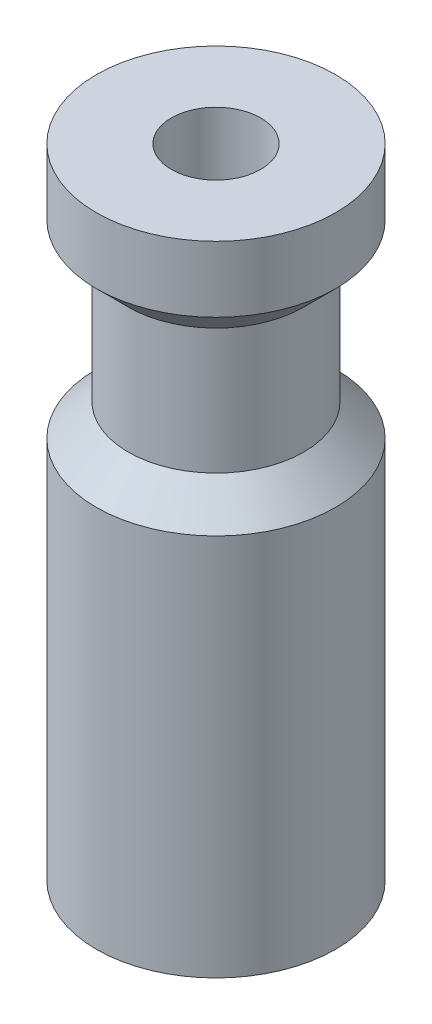
ISO-10303-21;
HEADER;
FILE_DESCRIPTION(('STEP AP214'),'2;1');
FILE_NAME('part.step','',(''),(''),'','','');
FILE_SCHEMA(('AUTOMOTIVE_DESIGN { 1 0 10303 214 1 1 1 1 }'));
ENDSEC;
DATA;
#1=APPLICATION_CONTEXT('core data for automotive mechanical design processes');
#2=APPLICATION_PROTOCOL_DEFINITION('international standard','automotive_design',2000,#1);
#3=PRODUCT_CONTEXT('',#1,'mechanical');
#4=PRODUCT('Part','Part','',(#3));
#5=PRODUCT_RELATED_PRODUCT_CATEGORY('part','',(#4));
#6=PRODUCT_DEFINITION_FORMATION('','',#4);
#7=PRODUCT_DEFINITION_CONTEXT('part definition',#1,'design');
#8=PRODUCT_DEFINITION('design','',#6,#7);
#9=PRODUCT_DEFINITION_SHAPE('','',#8);
#10=(LENGTH_UNIT() NAMED_UNIT(*) SI_UNIT(.MILLI.,.METRE.));
#11=(NAMED_UNIT(*) PLANE_ANGLE_UNIT() SI_UNIT($,.RADIAN.));
#12=(NAMED_UNIT(*) SI_UNIT($,.STERADIAN.) SOLID_ANGLE_UNIT());
#13=UNCERTAINTY_MEASURE_WITH_UNIT(LENGTH_MEASURE(1.E-05),#10,'distance_accuracy_value','');
#14=(GEOMETRIC_REPRESENTATION_CONTEXT(3) GLOBAL_UNCERTAINTY_ASSIGNED_CONTEXT((#13)) GLOBAL_UNIT_ASSIGNED_CONTEXT((#10,
#11,#12)) REPRESENTATION_CONTEXT('',''));
#15=CARTESIAN_POINT('',(0.,0.,0.));
#16=DIRECTION('',(0.,0.,1.));
#17=DIRECTION('',(1.,0.,0.));
#18=AXIS2_PLACEMENT_3D('',#15,#16,#17);
#19=CARTESIAN_POINT('',(0.,12.7,0.));
#20=DIRECTION('',(0.,1.,0.));
#21=DIRECTION('',(-1.,0.,0.));
#22=AXIS2_PLACEMENT_3D('',#19,#20,#21);
#23=PLANE('',#22);
#24=CARTESIAN_POINT('',(0.,12.7,0.));
#25=DIRECTION('',(0.,1.,0.));
#26=DIRECTION('',(-1.,0.,0.));
#27=AXIS2_PLACEMENT_3D('',#24,#25,#26);
#28=CIRCLE('',#27,1.778);
#29=CARTESIAN_POINT('',(-1.778,12.7,0.));
#30=VERTEX_POINT('',#29);
#31=EDGE_CURVE('E68',#30,#30,#28,.T.);
#32=ORIENTED_EDGE('',*,*,#31,.F.);
#33=EDGE_LOOP('',(#32));
#34=FACE_BOUND('',#33,.T.);
#35=CARTESIAN_POINT('',(0.,12.7,0.));
#36=DIRECTION('',(0.,-1.,0.));
#37=DIRECTION('',(1.,0.,0.));
#38=AXIS2_PLACEMENT_3D('',#35,#36,#37);
#39=CIRCLE('',#38,4.7625);
#40=CARTESIAN_POINT('',(4.76249999999999,12.7,0.));
#41=VERTEX_POINT('',#40);
#42=EDGE_CURVE('E10',#41,#41,#39,.T.);
#43=ORIENTED_EDGE('',*,*,#42,.F.);
#44=EDGE_LOOP('',(#43));
#45=FACE_BOUND('',#44,.T.);
#46=ADVANCED_FACE('F37',(#34,#45),#23,.T.);
#47=CARTESIAN_POINT('',(0.,12.7,0.));
#48=DIRECTION('',(0.,-1.,0.));
#49=DIRECTION('',(1.,0.,0.));
#50=AXIS2_PLACEMENT_3D('',#47,#48,#49);
#51=CYLINDRICAL_SURFACE('',#50,4.7625);
#52=ORIENTED_EDGE('',*,*,#42,.T.);
#53=EDGE_LOOP('',(#52));
#54=FACE_BOUND('',#53,.T.);
#55=CARTESIAN_POINT('',(0.,10.08,0.));
#56=DIRECTION('',(0.,-1.,0.));
#57=DIRECTION('',(1.,0.,0.));
#58=AXIS2_PLACEMENT_3D('',#55,#56,#57);
#59=CIRCLE('',#58,4.7625);
#60=CARTESIAN_POINT('',(4.76249999999999,10.08,0.));
#61=VERTEX_POINT('',#60);
#62=EDGE_CURVE('E45',#61,#61,#59,.T.);
#63=ORIENTED_EDGE('',*,*,#62,.F.);
#64=EDGE_LOOP('',(#63));
#65=FACE_BOUND('',#64,.T.);
#66=ADVANCED_FACE('F97',(#54,#65),#51,.T.);
#67=CARTESIAN_POINT('',(0.,8.81,0.));
#68=DIRECTION('',(0.,1.,0.));
#69=DIRECTION('',(-1.,0.,0.));
#70=AXIS2_PLACEMENT_3D('',#67,#68,#69);
#71=CONICAL_SURFACE('',#70,3.4925,0.785398163397446);
#72=ORIENTED_EDGE('',*,*,#62,.T.);
#73=EDGE_LOOP('',(#72));
#74=FACE_BOUND('',#73,.T.);
#75=CARTESIAN_POINT('',(0.,8.81,0.));
#76=DIRECTION('',(0.,-1.,0.));
#77=DIRECTION('',(1.,0.,0.));
#78=AXIS2_PLACEMENT_3D('',#75,#76,#77);
#79=CIRCLE('',#78,3.4925);
#80=CARTESIAN_POINT('',(3.4925,8.81,0.));
#81=VERTEX_POINT('',#80);
#82=EDGE_CURVE('E50',#81,#81,#79,.T.);
#83=ORIENTED_EDGE('',*,*,#82,.F.);
#84=EDGE_LOOP('',(#83));
#85=FACE_BOUND('',#84,.T.);
#86=ADVANCED_FACE('F102',(#74,#85),#71,.T.);
#87=CARTESIAN_POINT('',(0.,12.7,0.));
#88=DIRECTION('',(0.,-1.,0.));
#89=DIRECTION('',(1.,0.,0.));
#90=AXIS2_PLACEMENT_3D('',#87,#88,#89);
#91=CYLINDRICAL_SURFACE('',#90,3.4925);
#92=ORIENTED_EDGE('',*,*,#82,.T.);
#93=EDGE_LOOP('',(#92));
#94=FACE_BOUND('',#93,.T.);
#95=CARTESIAN_POINT('',(0.,3.81,0.));
#96=DIRECTION('',(0.,-1.,0.));
#97=DIRECTION('',(1.,0.,0.));
#98=AXIS2_PLACEMENT_3D('',#95,#96,#97);
#99=CIRCLE('',#98,3.4925);
#100=CARTESIAN_POINT('',(3.4925,3.81,0.));
#101=VERTEX_POINT('',#100);
#102=EDGE_CURVE('E56',#101,#101,#99,.T.);
#103=ORIENTED_EDGE('',*,*,#102,.F.);
#104=EDGE_LOOP('',(#103));
#105=FACE_BOUND('',#104,.T.);
#106=ADVANCED_FACE('F93',(#94,#105),#91,.T.);
#107=CARTESIAN_POINT('',(0.,2.54,0.));
#108=DIRECTION('',(0.,-1.,0.));
#109=DIRECTION('',(1.,0.,0.));
#110=AXIS2_PLACEMENT_3D('',#107,#108,#109);
#111=CONICAL_SURFACE('',#110,4.7625,0.78539816339745);
#112=ORIENTED_EDGE('',*,*,#102,.T.);
#113=EDGE_LOOP('',(#112));
#114=FACE_BOUND('',#113,.T.);
#115=CARTESIAN_POINT('',(0.,2.54,0.));
#116=DIRECTION('',(0.,-1.,0.));
#117=DIRECTION('',(1.,0.,0.));
#118=AXIS2_PLACEMENT_3D('',#115,#116,#117);
#119=CIRCLE('',#118,4.7625);
#120=CARTESIAN_POINT('',(4.7625,2.54,0.));
#121=VERTEX_POINT('',#120);
#122=EDGE_CURVE('E60',#121,#121,#119,.T.);
#123=ORIENTED_EDGE('',*,*,#122,.F.);
#124=EDGE_LOOP('',(#123));
#125=FACE_BOUND('',#124,.T.);
#126=ADVANCED_FACE('F87',(#114,#125),#111,.T.);
#127=CARTESIAN_POINT('',(0.,12.7,0.));
#128=DIRECTION('',(0.,-1.,0.));
#129=DIRECTION('',(1.,0.,0.));
#130=AXIS2_PLACEMENT_3D('',#127,#128,#129);
#131=CYLINDRICAL_SURFACE('',#130,4.7625);
#132=ORIENTED_EDGE('',*,*,#122,.T.);
#133=EDGE_LOOP('',(#132));
#134=FACE_BOUND('',#133,.T.);
#135=CARTESIAN_POINT('',(0.,-12.7,0.));
#136=DIRECTION('',(0.,-1.,0.));
#137=DIRECTION('',(1.,0.,0.));
#138=AXIS2_PLACEMENT_3D('',#135,#136,#137);
#139=CIRCLE('',#138,4.7625);
#140=CARTESIAN_POINT('',(4.7625,-12.7,0.));
#141=VERTEX_POINT('',#140);
#142=EDGE_CURVE('E64',#141,#141,#139,.T.);
#143=ORIENTED_EDGE('',*,*,#142,.F.);
#144=EDGE_LOOP('',(#143));
#145=FACE_BOUND('',#144,.T.);
#146=ADVANCED_FACE('F82',(#134,#145),#131,.T.);
#147=CARTESIAN_POINT('',(4.7625,-12.7,0.));
#148=DIRECTION('',(0.,-1.,0.));
#149=DIRECTION('',(1.,0.,0.));
#150=AXIS2_PLACEMENT_3D('',#147,#148,#149);
#151=PLANE('',#150);
#152=CARTESIAN_POINT('',(0.,-12.7,0.));
#153=DIRECTION('',(0.,-1.,0.));
#154=DIRECTION('',(1.,0.,0.));
#155=AXIS2_PLACEMENT_3D('',#152,#153,#154);
#156=CIRCLE('',#155,1.778);
#157=CARTESIAN_POINT('',(1.778,-12.7,0.));
#158=VERTEX_POINT('',#157);
#159=EDGE_CURVE('E40',#158,#158,#156,.T.);
#160=ORIENTED_EDGE('',*,*,#159,.F.);
#161=EDGE_LOOP('',(#160));
#162=FACE_BOUND('',#161,.T.);
#163=ORIENTED_EDGE('',*,*,#142,.T.);
#164=EDGE_LOOP('',(#163));
#165=FACE_BOUND('',#164,.T.);
#166=ADVANCED_FACE('F79',(#162,#165),#151,.T.);
#167=CARTESIAN_POINT('',(0.,-15.24,0.));
#168=DIRECTION('',(0.,1.,0.));
#169=DIRECTION('',(-1.,0.,0.));
#170=AXIS2_PLACEMENT_3D('',#167,#168,#169);
#171=CYLINDRICAL_SURFACE('',#170,1.778);
#172=ORIENTED_EDGE('',*,*,#159,.T.);
#173=EDGE_LOOP('',(#172));
#174=FACE_BOUND('',#173,.T.);
#175=ORIENTED_EDGE('',*,*,#31,.T.);
#176=EDGE_LOOP('',(#175));
#177=FACE_BOUND('',#176,.T.);
#178=ADVANCED_FACE('F77',(#174,#177),#171,.F.);
#179=CLOSED_SHELL('',(#46,#66,#86,#106,#126,#146,#166,#178));
#180=MANIFOLD_SOLID_BREP('B2',#179);
#181=ADVANCED_BREP_SHAPE_REPRESENTATION('',(#18,#180),#14);
#182=SHAPE_DEFINITION_REPRESENTATION(#9,#181);
ENDSEC;
END-ISO-10303-21;
